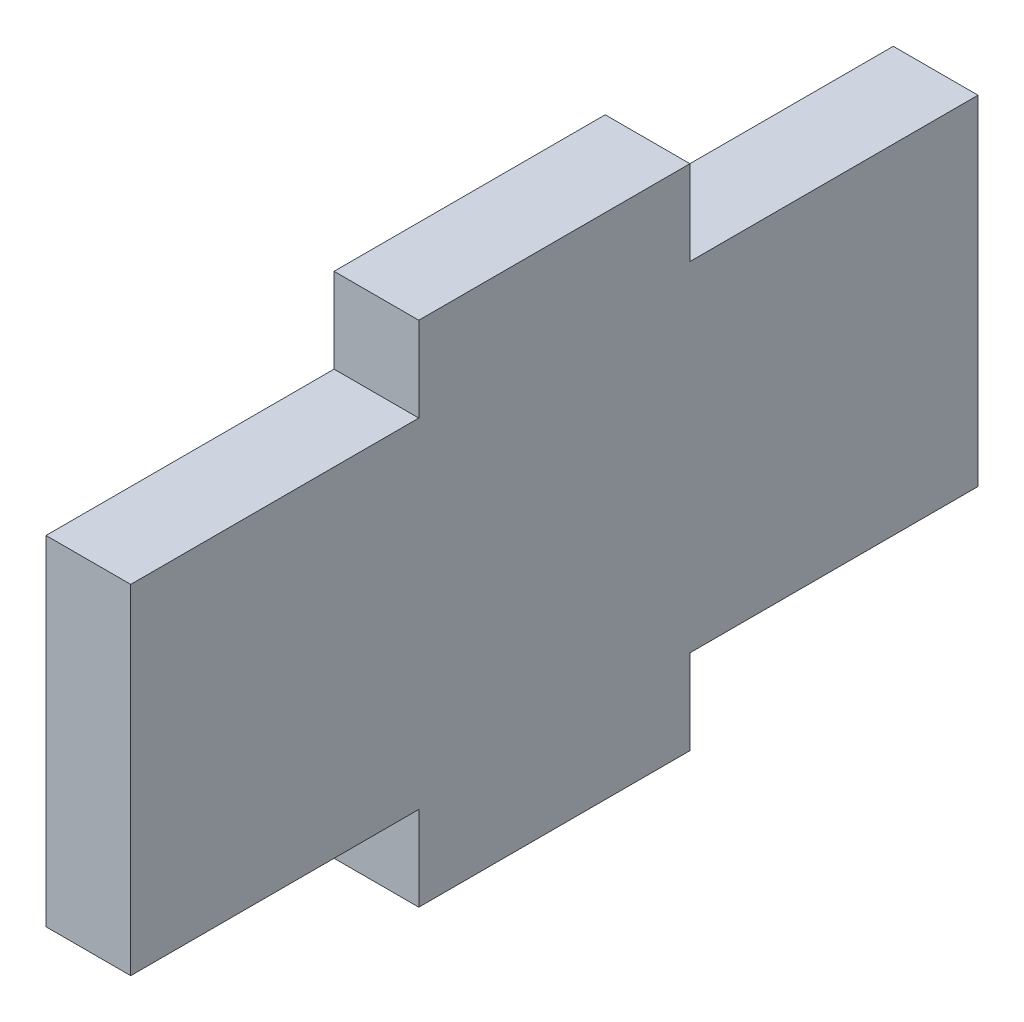
ISO-10303-21;
HEADER;
FILE_DESCRIPTION(('STEP AP214'),'2;1');
FILE_NAME('part.step','',(''),(''),'','','');
FILE_SCHEMA(('AUTOMOTIVE_DESIGN { 1 0 10303 214 1 1 1 1 }'));
ENDSEC;
DATA;
#1=APPLICATION_CONTEXT('core data for automotive mechanical design processes');
#2=APPLICATION_PROTOCOL_DEFINITION('international standard','automotive_design',2000,#1);
#3=PRODUCT_CONTEXT('',#1,'mechanical');
#4=PRODUCT('Part','Part','',(#3));
#5=PRODUCT_RELATED_PRODUCT_CATEGORY('part','',(#4));
#6=PRODUCT_DEFINITION_FORMATION('','',#4);
#7=PRODUCT_DEFINITION_CONTEXT('part definition',#1,'design');
#8=PRODUCT_DEFINITION('design','',#6,#7);
#9=PRODUCT_DEFINITION_SHAPE('','',#8);
#10=(LENGTH_UNIT() NAMED_UNIT(*) SI_UNIT(.MILLI.,.METRE.));
#11=(NAMED_UNIT(*) PLANE_ANGLE_UNIT() SI_UNIT($,.RADIAN.));
#12=(NAMED_UNIT(*) SI_UNIT($,.STERADIAN.) SOLID_ANGLE_UNIT());
#13=UNCERTAINTY_MEASURE_WITH_UNIT(LENGTH_MEASURE(1.E-05),#10,'distance_accuracy_value','');
#14=(GEOMETRIC_REPRESENTATION_CONTEXT(3) GLOBAL_UNCERTAINTY_ASSIGNED_CONTEXT((#13)) GLOBAL_UNIT_ASSIGNED_CONTEXT((#10,
#11,#12)) REPRESENTATION_CONTEXT('',''));
#15=CARTESIAN_POINT('',(0.,0.,0.));
#16=DIRECTION('',(0.,0.,1.));
#17=DIRECTION('',(1.,0.,0.));
#18=AXIS2_PLACEMENT_3D('',#15,#16,#17);
#19=CARTESIAN_POINT('',(5.,10.,-25.));
#20=DIRECTION('',(0.,0.,1.));
#21=DIRECTION('',(0.,-1.,0.));
#22=AXIS2_PLACEMENT_3D('',#19,#20,#21);
#23=PLANE('',#22);
#24=DIRECTION('',(0.,1.,0.));
#25=VECTOR('',#24,1.);
#26=CARTESIAN_POINT('',(0.,10.,-25.));
#27=LINE('',#26,#25);
#28=CARTESIAN_POINT('',(0.,-10.,-25.));
#29=VERTEX_POINT('',#28);
#30=CARTESIAN_POINT('',(0.,10.,-25.));
#31=VERTEX_POINT('',#30);
#32=EDGE_CURVE('E170',#29,#31,#27,.T.);
#33=ORIENTED_EDGE('',*,*,#32,.T.);
#34=DIRECTION('',(-1.,0.,0.));
#35=VECTOR('',#34,1.);
#36=CARTESIAN_POINT('',(5.,10.,-25.));
#37=LINE('',#36,#35);
#38=CARTESIAN_POINT('',(5.,10.,-25.));
#39=VERTEX_POINT('',#38);
#40=EDGE_CURVE('E50',#39,#31,#37,.T.);
#41=ORIENTED_EDGE('',*,*,#40,.F.);
#42=DIRECTION('',(0.,1.,0.));
#43=VECTOR('',#42,1.);
#44=CARTESIAN_POINT('',(5.,10.,-25.));
#45=LINE('',#44,#43);
#46=CARTESIAN_POINT('',(5.,-10.,-25.));
#47=VERTEX_POINT('',#46);
#48=EDGE_CURVE('E114',#47,#39,#45,.T.);
#49=ORIENTED_EDGE('',*,*,#48,.F.);
#50=DIRECTION('',(-1.,0.,0.));
#51=VECTOR('',#50,1.);
#52=CARTESIAN_POINT('',(5.,-10.,-25.));
#53=LINE('',#52,#51);
#54=EDGE_CURVE('E11',#47,#29,#53,.T.);
#55=ORIENTED_EDGE('',*,*,#54,.T.);
#56=EDGE_LOOP('',(#33,#41,#49,#55));
#57=FACE_BOUND('',#56,.T.);
#58=ADVANCED_FACE('F41',(#57),#23,.F.);
#59=CARTESIAN_POINT('',(5.,10.,-8.));
#60=DIRECTION('',(0.,-1.,0.));
#61=DIRECTION('',(0.,0.,-1.));
#62=AXIS2_PLACEMENT_3D('',#59,#60,#61);
#63=PLANE('',#62);
#64=DIRECTION('',(0.,0.,1.));
#65=VECTOR('',#64,1.);
#66=CARTESIAN_POINT('',(0.,10.,-8.));
#67=LINE('',#66,#65);
#68=CARTESIAN_POINT('',(0.,10.,-8.));
#69=VERTEX_POINT('',#68);
#70=EDGE_CURVE('E174',#31,#69,#67,.T.);
#71=ORIENTED_EDGE('',*,*,#70,.T.);
#72=DIRECTION('',(-1.,0.,0.));
#73=VECTOR('',#72,1.);
#74=CARTESIAN_POINT('',(5.,10.,-8.));
#75=LINE('',#74,#73);
#76=CARTESIAN_POINT('',(5.,10.,-8.));
#77=VERTEX_POINT('',#76);
#78=EDGE_CURVE('E232',#77,#69,#75,.T.);
#79=ORIENTED_EDGE('',*,*,#78,.F.);
#80=DIRECTION('',(0.,0.,1.));
#81=VECTOR('',#80,1.);
#82=CARTESIAN_POINT('',(5.,10.,-20.));
#83=LINE('',#82,#81);
#84=EDGE_CURVE('E241',#39,#77,#83,.T.);
#85=ORIENTED_EDGE('',*,*,#84,.F.);
#86=ORIENTED_EDGE('',*,*,#40,.T.);
#87=EDGE_LOOP('',(#71,#79,#85,#86));
#88=FACE_BOUND('',#87,.T.);
#89=ADVANCED_FACE('F239',(#88),#63,.F.);
#90=CARTESIAN_POINT('',(5.,15.,-8.));
#91=DIRECTION('',(0.,0.,1.));
#92=DIRECTION('',(1.,0.,0.));
#93=AXIS2_PLACEMENT_3D('',#90,#91,#92);
#94=PLANE('',#93);
#95=DIRECTION('',(0.,1.,0.));
#96=VECTOR('',#95,1.);
#97=CARTESIAN_POINT('',(0.,15.,-8.));
#98=LINE('',#97,#96);
#99=CARTESIAN_POINT('',(0.,15.,-8.));
#100=VERTEX_POINT('',#99);
#101=EDGE_CURVE('E177',#69,#100,#98,.T.);
#102=ORIENTED_EDGE('',*,*,#101,.T.);
#103=DIRECTION('',(-1.,0.,0.));
#104=VECTOR('',#103,1.);
#105=CARTESIAN_POINT('',(5.,15.,-8.));
#106=LINE('',#105,#104);
#107=CARTESIAN_POINT('',(5.,15.,-8.));
#108=VERTEX_POINT('',#107);
#109=EDGE_CURVE('E228',#108,#100,#106,.T.);
#110=ORIENTED_EDGE('',*,*,#109,.F.);
#111=DIRECTION('',(0.,1.,0.));
#112=VECTOR('',#111,1.);
#113=CARTESIAN_POINT('',(5.,15.,-8.));
#114=LINE('',#113,#112);
#115=EDGE_CURVE('E261',#77,#108,#114,.T.);
#116=ORIENTED_EDGE('',*,*,#115,.F.);
#117=ORIENTED_EDGE('',*,*,#78,.T.);
#118=EDGE_LOOP('',(#102,#110,#116,#117));
#119=FACE_BOUND('',#118,.T.);
#120=ADVANCED_FACE('F251',(#119),#94,.F.);
#121=CARTESIAN_POINT('',(5.,15.,8.));
#122=DIRECTION('',(0.,-1.,0.));
#123=DIRECTION('',(0.,0.,-1.));
#124=AXIS2_PLACEMENT_3D('',#121,#122,#123);
#125=PLANE('',#124);
#126=DIRECTION('',(0.,0.,1.));
#127=VECTOR('',#126,1.);
#128=CARTESIAN_POINT('',(0.,15.,8.));
#129=LINE('',#128,#127);
#130=CARTESIAN_POINT('',(0.,15.,8.));
#131=VERTEX_POINT('',#130);
#132=EDGE_CURVE('E180',#100,#131,#129,.T.);
#133=ORIENTED_EDGE('',*,*,#132,.T.);
#134=DIRECTION('',(-1.,0.,0.));
#135=VECTOR('',#134,1.);
#136=CARTESIAN_POINT('',(5.,15.,8.));
#137=LINE('',#136,#135);
#138=CARTESIAN_POINT('',(5.,15.,8.));
#139=VERTEX_POINT('',#138);
#140=EDGE_CURVE('E224',#139,#131,#137,.T.);
#141=ORIENTED_EDGE('',*,*,#140,.F.);
#142=DIRECTION('',(0.,0.,1.));
#143=VECTOR('',#142,1.);
#144=CARTESIAN_POINT('',(5.,15.,8.));
#145=LINE('',#144,#143);
#146=EDGE_CURVE('E257',#108,#139,#145,.T.);
#147=ORIENTED_EDGE('',*,*,#146,.F.);
#148=ORIENTED_EDGE('',*,*,#109,.T.);
#149=EDGE_LOOP('',(#133,#141,#147,#148));
#150=FACE_BOUND('',#149,.T.);
#151=ADVANCED_FACE('F255',(#150),#125,.F.);
#152=CARTESIAN_POINT('',(5.,10.,8.));
#153=DIRECTION('',(0.,0.,-1.));
#154=DIRECTION('',(-1.,0.,0.));
#155=AXIS2_PLACEMENT_3D('',#152,#153,#154);
#156=PLANE('',#155);
#157=DIRECTION('',(0.,-1.,0.));
#158=VECTOR('',#157,1.);
#159=CARTESIAN_POINT('',(0.,10.,8.));
#160=LINE('',#159,#158);
#161=CARTESIAN_POINT('',(0.,10.,8.));
#162=VERTEX_POINT('',#161);
#163=EDGE_CURVE('E183',#131,#162,#160,.T.);
#164=ORIENTED_EDGE('',*,*,#163,.T.);
#165=DIRECTION('',(-1.,0.,0.));
#166=VECTOR('',#165,1.);
#167=CARTESIAN_POINT('',(5.,10.,8.));
#168=LINE('',#167,#166);
#169=CARTESIAN_POINT('',(5.,10.,8.));
#170=VERTEX_POINT('',#169);
#171=EDGE_CURVE('E220',#170,#162,#168,.T.);
#172=ORIENTED_EDGE('',*,*,#171,.F.);
#173=DIRECTION('',(0.,-1.,0.));
#174=VECTOR('',#173,1.);
#175=CARTESIAN_POINT('',(5.,10.,8.));
#176=LINE('',#175,#174);
#177=EDGE_CURVE('E260',#139,#170,#176,.T.);
#178=ORIENTED_EDGE('',*,*,#177,.F.);
#179=ORIENTED_EDGE('',*,*,#140,.T.);
#180=EDGE_LOOP('',(#164,#172,#178,#179));
#181=FACE_BOUND('',#180,.T.);
#182=ADVANCED_FACE('F287',(#181),#156,.F.);
#183=CARTESIAN_POINT('',(5.,10.,20.));
#184=DIRECTION('',(0.,-1.,0.));
#185=DIRECTION('',(0.,0.,-1.));
#186=AXIS2_PLACEMENT_3D('',#183,#184,#185);
#187=PLANE('',#186);
#188=DIRECTION('',(0.,0.,1.));
#189=VECTOR('',#188,1.);
#190=CARTESIAN_POINT('',(0.,10.,20.));
#191=LINE('',#190,#189);
#192=CARTESIAN_POINT('',(0.,10.,25.));
#193=VERTEX_POINT('',#192);
#194=EDGE_CURVE('E187',#162,#193,#191,.T.);
#195=ORIENTED_EDGE('',*,*,#194,.T.);
#196=DIRECTION('',(-1.,0.,0.));
#197=VECTOR('',#196,1.);
#198=CARTESIAN_POINT('',(5.,10.,25.));
#199=LINE('',#198,#197);
#200=CARTESIAN_POINT('',(5.,10.,25.));
#201=VERTEX_POINT('',#200);
#202=EDGE_CURVE('E216',#201,#193,#199,.T.);
#203=ORIENTED_EDGE('',*,*,#202,.F.);
#204=DIRECTION('',(0.,0.,1.));
#205=VECTOR('',#204,1.);
#206=CARTESIAN_POINT('',(5.,10.,20.));
#207=LINE('',#206,#205);
#208=EDGE_CURVE('E265',#170,#201,#207,.T.);
#209=ORIENTED_EDGE('',*,*,#208,.F.);
#210=ORIENTED_EDGE('',*,*,#171,.T.);
#211=EDGE_LOOP('',(#195,#203,#209,#210));
#212=FACE_BOUND('',#211,.T.);
#213=ADVANCED_FACE('F288',(#212),#187,.F.);
#214=CARTESIAN_POINT('',(5.,10.,25.));
#215=DIRECTION('',(0.,0.,-1.));
#216=DIRECTION('',(0.,1.,0.));
#217=AXIS2_PLACEMENT_3D('',#214,#215,#216);
#218=PLANE('',#217);
#219=DIRECTION('',(0.,-1.,0.));
#220=VECTOR('',#219,1.);
#221=CARTESIAN_POINT('',(0.,10.,25.));
#222=LINE('',#221,#220);
#223=CARTESIAN_POINT('',(0.,-10.,25.));
#224=VERTEX_POINT('',#223);
#225=EDGE_CURVE('E190',#193,#224,#222,.T.);
#226=ORIENTED_EDGE('',*,*,#225,.T.);
#227=DIRECTION('',(-1.,0.,0.));
#228=VECTOR('',#227,1.);
#229=CARTESIAN_POINT('',(5.,-10.,25.));
#230=LINE('',#229,#228);
#231=CARTESIAN_POINT('',(5.,-10.,25.));
#232=VERTEX_POINT('',#231);
#233=EDGE_CURVE('E212',#232,#224,#230,.T.);
#234=ORIENTED_EDGE('',*,*,#233,.F.);
#235=DIRECTION('',(0.,-1.,0.));
#236=VECTOR('',#235,1.);
#237=CARTESIAN_POINT('',(5.,10.,25.));
#238=LINE('',#237,#236);
#239=EDGE_CURVE('E272',#201,#232,#238,.T.);
#240=ORIENTED_EDGE('',*,*,#239,.F.);
#241=ORIENTED_EDGE('',*,*,#202,.T.);
#242=EDGE_LOOP('',(#226,#234,#240,#241));
#243=FACE_BOUND('',#242,.T.);
#244=ADVANCED_FACE('F280',(#243),#218,.F.);
#245=CARTESIAN_POINT('',(5.,-10.,20.));
#246=DIRECTION('',(0.,1.,0.));
#247=DIRECTION('',(0.,0.,1.));
#248=AXIS2_PLACEMENT_3D('',#245,#246,#247);
#249=PLANE('',#248);
#250=DIRECTION('',(0.,0.,-1.));
#251=VECTOR('',#250,1.);
#252=CARTESIAN_POINT('',(0.,-10.,20.));
#253=LINE('',#252,#251);
#254=CARTESIAN_POINT('',(0.,-10.,8.));
#255=VERTEX_POINT('',#254);
#256=EDGE_CURVE('E194',#224,#255,#253,.T.);
#257=ORIENTED_EDGE('',*,*,#256,.T.);
#258=DIRECTION('',(-1.,0.,0.));
#259=VECTOR('',#258,1.);
#260=CARTESIAN_POINT('',(5.,-10.,8.));
#261=LINE('',#260,#259);
#262=CARTESIAN_POINT('',(5.,-10.,8.));
#263=VERTEX_POINT('',#262);
#264=EDGE_CURVE('E157',#263,#255,#261,.T.);
#265=ORIENTED_EDGE('',*,*,#264,.F.);
#266=DIRECTION('',(0.,0.,-1.));
#267=VECTOR('',#266,1.);
#268=CARTESIAN_POINT('',(5.,-10.,25.));
#269=LINE('',#268,#267);
#270=EDGE_CURVE('E146',#232,#263,#269,.T.);
#271=ORIENTED_EDGE('',*,*,#270,.F.);
#272=ORIENTED_EDGE('',*,*,#233,.T.);
#273=EDGE_LOOP('',(#257,#265,#271,#272));
#274=FACE_BOUND('',#273,.T.);
#275=ADVANCED_FACE('F283',(#274),#249,.F.);
#276=CARTESIAN_POINT('',(5.,-10.,8.));
#277=DIRECTION('',(0.,0.,-1.));
#278=DIRECTION('',(-1.,0.,0.));
#279=AXIS2_PLACEMENT_3D('',#276,#277,#278);
#280=PLANE('',#279);
#281=DIRECTION('',(0.,-1.,0.));
#282=VECTOR('',#281,1.);
#283=CARTESIAN_POINT('',(0.,-10.,8.));
#284=LINE('',#283,#282);
#285=CARTESIAN_POINT('',(0.,-15.,8.));
#286=VERTEX_POINT('',#285);
#287=EDGE_CURVE('E155',#255,#286,#284,.T.);
#288=ORIENTED_EDGE('',*,*,#287,.T.);
#289=DIRECTION('',(-1.,0.,0.));
#290=VECTOR('',#289,1.);
#291=CARTESIAN_POINT('',(5.,-15.,8.));
#292=LINE('',#291,#290);
#293=CARTESIAN_POINT('',(5.,-15.,8.));
#294=VERTEX_POINT('',#293);
#295=EDGE_CURVE('E152',#294,#286,#292,.T.);
#296=ORIENTED_EDGE('',*,*,#295,.F.);
#297=DIRECTION('',(0.,-1.,0.));
#298=VECTOR('',#297,1.);
#299=CARTESIAN_POINT('',(5.,-10.,8.));
#300=LINE('',#299,#298);
#301=EDGE_CURVE('E140',#263,#294,#300,.T.);
#302=ORIENTED_EDGE('',*,*,#301,.F.);
#303=ORIENTED_EDGE('',*,*,#264,.T.);
#304=EDGE_LOOP('',(#288,#296,#302,#303));
#305=FACE_BOUND('',#304,.T.);
#306=ADVANCED_FACE('F153',(#305),#280,.F.);
#307=CARTESIAN_POINT('',(5.,-15.,8.));
#308=DIRECTION('',(0.,1.,0.));
#309=DIRECTION('',(0.,0.,1.));
#310=AXIS2_PLACEMENT_3D('',#307,#308,#309);
#311=PLANE('',#310);
#312=DIRECTION('',(0.,0.,-1.));
#313=VECTOR('',#312,1.);
#314=CARTESIAN_POINT('',(0.,-15.,8.));
#315=LINE('',#314,#313);
#316=CARTESIAN_POINT('',(0.,-15.,-8.));
#317=VERTEX_POINT('',#316);
#318=EDGE_CURVE('E100',#286,#317,#315,.T.);
#319=ORIENTED_EDGE('',*,*,#318,.T.);
#320=DIRECTION('',(-1.,0.,0.));
#321=VECTOR('',#320,1.);
#322=CARTESIAN_POINT('',(5.,-15.,-8.));
#323=LINE('',#322,#321);
#324=CARTESIAN_POINT('',(5.,-15.,-8.));
#325=VERTEX_POINT('',#324);
#326=EDGE_CURVE('E158',#325,#317,#323,.T.);
#327=ORIENTED_EDGE('',*,*,#326,.F.);
#328=DIRECTION('',(0.,0.,-1.));
#329=VECTOR('',#328,1.);
#330=CARTESIAN_POINT('',(5.,-15.,8.));
#331=LINE('',#330,#329);
#332=EDGE_CURVE('E144',#294,#325,#331,.T.);
#333=ORIENTED_EDGE('',*,*,#332,.F.);
#334=ORIENTED_EDGE('',*,*,#295,.T.);
#335=EDGE_LOOP('',(#319,#327,#333,#334));
#336=FACE_BOUND('',#335,.T.);
#337=ADVANCED_FACE('F160',(#336),#311,.F.);
#338=CARTESIAN_POINT('',(5.,-15.,-8.));
#339=DIRECTION('',(0.,0.,1.));
#340=DIRECTION('',(1.,0.,0.));
#341=AXIS2_PLACEMENT_3D('',#338,#339,#340);
#342=PLANE('',#341);
#343=DIRECTION('',(0.,1.,0.));
#344=VECTOR('',#343,1.);
#345=CARTESIAN_POINT('',(0.,-15.,-8.));
#346=LINE('',#345,#344);
#347=CARTESIAN_POINT('',(0.,-10.,-8.));
#348=VERTEX_POINT('',#347);
#349=EDGE_CURVE('E107',#317,#348,#346,.T.);
#350=ORIENTED_EDGE('',*,*,#349,.T.);
#351=DIRECTION('',(-1.,0.,0.));
#352=VECTOR('',#351,1.);
#353=CARTESIAN_POINT('',(5.,-10.,-8.));
#354=LINE('',#353,#352);
#355=CARTESIAN_POINT('',(5.,-10.,-8.));
#356=VERTEX_POINT('',#355);
#357=EDGE_CURVE('E166',#356,#348,#354,.T.);
#358=ORIENTED_EDGE('',*,*,#357,.F.);
#359=DIRECTION('',(0.,1.,0.));
#360=VECTOR('',#359,1.);
#361=CARTESIAN_POINT('',(5.,-15.,-8.));
#362=LINE('',#361,#360);
#363=EDGE_CURVE('E163',#325,#356,#362,.T.);
#364=ORIENTED_EDGE('',*,*,#363,.F.);
#365=ORIENTED_EDGE('',*,*,#326,.T.);
#366=EDGE_LOOP('',(#350,#358,#364,#365));
#367=FACE_BOUND('',#366,.T.);
#368=ADVANCED_FACE('F352',(#367),#342,.F.);
#369=CARTESIAN_POINT('',(5.,-10.,-8.));
#370=DIRECTION('',(0.,1.,0.));
#371=DIRECTION('',(0.,0.,1.));
#372=AXIS2_PLACEMENT_3D('',#369,#370,#371);
#373=PLANE('',#372);
#374=DIRECTION('',(0.,0.,-1.));
#375=VECTOR('',#374,1.);
#376=CARTESIAN_POINT('',(0.,-10.,-8.));
#377=LINE('',#376,#375);
#378=EDGE_CURVE('E203',#348,#29,#377,.T.);
#379=ORIENTED_EDGE('',*,*,#378,.T.);
#380=ORIENTED_EDGE('',*,*,#54,.F.);
#381=DIRECTION('',(0.,0.,-1.));
#382=VECTOR('',#381,1.);
#383=CARTESIAN_POINT('',(5.,-10.,-25.));
#384=LINE('',#383,#382);
#385=EDGE_CURVE('E58',#356,#47,#384,.T.);
#386=ORIENTED_EDGE('',*,*,#385,.F.);
#387=ORIENTED_EDGE('',*,*,#357,.T.);
#388=EDGE_LOOP('',(#379,#380,#386,#387));
#389=FACE_BOUND('',#388,.T.);
#390=ADVANCED_FACE('F361',(#389),#373,.F.);
#391=CARTESIAN_POINT('',(5.,0.,0.));
#392=DIRECTION('',(-1.,0.,0.));
#393=DIRECTION('',(0.,0.,1.));
#394=AXIS2_PLACEMENT_3D('',#391,#392,#393);
#395=PLANE('',#394);
#396=ORIENTED_EDGE('',*,*,#385,.T.);
#397=ORIENTED_EDGE('',*,*,#48,.T.);
#398=ORIENTED_EDGE('',*,*,#84,.T.);
#399=ORIENTED_EDGE('',*,*,#115,.T.);
#400=ORIENTED_EDGE('',*,*,#146,.T.);
#401=ORIENTED_EDGE('',*,*,#177,.T.);
#402=ORIENTED_EDGE('',*,*,#208,.T.);
#403=ORIENTED_EDGE('',*,*,#239,.T.);
#404=ORIENTED_EDGE('',*,*,#270,.T.);
#405=ORIENTED_EDGE('',*,*,#301,.T.);
#406=ORIENTED_EDGE('',*,*,#332,.T.);
#407=ORIENTED_EDGE('',*,*,#363,.T.);
#408=EDGE_LOOP('',(#396,#397,#398,#399,#400,#401,#402,#403,#404,#405,#406,#407));
#409=FACE_BOUND('',#408,.T.);
#410=ADVANCED_FACE('F142',(#409),#395,.F.);
#411=CARTESIAN_POINT('',(0.,0.,0.));
#412=DIRECTION('',(-1.,0.,0.));
#413=DIRECTION('',(0.,0.,1.));
#414=AXIS2_PLACEMENT_3D('',#411,#412,#413);
#415=PLANE('',#414);
#416=ORIENTED_EDGE('',*,*,#32,.F.);
#417=ORIENTED_EDGE('',*,*,#378,.F.);
#418=ORIENTED_EDGE('',*,*,#349,.F.);
#419=ORIENTED_EDGE('',*,*,#318,.F.);
#420=ORIENTED_EDGE('',*,*,#287,.F.);
#421=ORIENTED_EDGE('',*,*,#256,.F.);
#422=ORIENTED_EDGE('',*,*,#225,.F.);
#423=ORIENTED_EDGE('',*,*,#194,.F.);
#424=ORIENTED_EDGE('',*,*,#163,.F.);
#425=ORIENTED_EDGE('',*,*,#132,.F.);
#426=ORIENTED_EDGE('',*,*,#101,.F.);
#427=ORIENTED_EDGE('',*,*,#70,.F.);
#428=EDGE_LOOP('',(#416,#417,#418,#419,#420,#421,#422,#423,#424,#425,#426,#427));
#429=FACE_BOUND('',#428,.T.);
#430=ADVANCED_FACE('F245',(#429),#415,.T.);
#431=CLOSED_SHELL('',(#58,#89,#120,#151,#182,#213,#244,#275,#306,#337,#368,#390,#410,#430));
#432=MANIFOLD_SOLID_BREP('B2',#431);
#433=ADVANCED_BREP_SHAPE_REPRESENTATION('',(#18,#432),#14);
#434=SHAPE_DEFINITION_REPRESENTATION(#9,#433);
ENDSEC;
END-ISO-10303-21;
